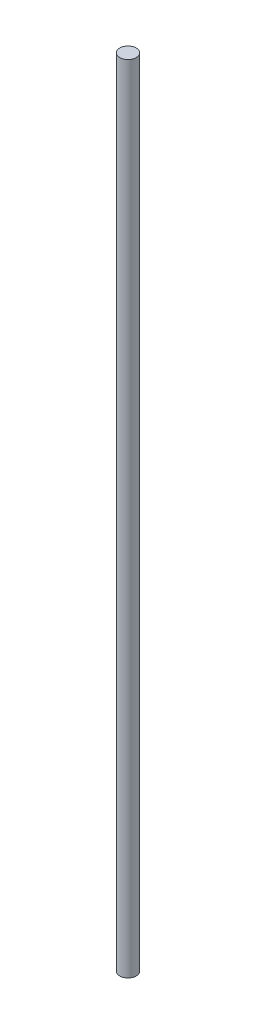
ISO-10303-21;
HEADER;
FILE_DESCRIPTION(('STEP AP214'),'2;1');
FILE_NAME('part.step','',(''),(''),'','','');
FILE_SCHEMA(('AUTOMOTIVE_DESIGN { 1 0 10303 214 1 1 1 1 }'));
ENDSEC;
DATA;
#1=APPLICATION_CONTEXT('core data for automotive mechanical design processes');
#2=APPLICATION_PROTOCOL_DEFINITION('international standard','automotive_design',2000,#1);
#3=PRODUCT_CONTEXT('',#1,'mechanical');
#4=PRODUCT('Part','Part','',(#3));
#5=PRODUCT_RELATED_PRODUCT_CATEGORY('part','',(#4));
#6=PRODUCT_DEFINITION_FORMATION('','',#4);
#7=PRODUCT_DEFINITION_CONTEXT('part definition',#1,'design');
#8=PRODUCT_DEFINITION('design','',#6,#7);
#9=PRODUCT_DEFINITION_SHAPE('','',#8);
#10=(LENGTH_UNIT() NAMED_UNIT(*) SI_UNIT(.MILLI.,.METRE.));
#11=(NAMED_UNIT(*) PLANE_ANGLE_UNIT() SI_UNIT($,.RADIAN.));
#12=(NAMED_UNIT(*) SI_UNIT($,.STERADIAN.) SOLID_ANGLE_UNIT());
#13=UNCERTAINTY_MEASURE_WITH_UNIT(LENGTH_MEASURE(1.E-05),#10,'distance_accuracy_value','');
#14=(GEOMETRIC_REPRESENTATION_CONTEXT(3) GLOBAL_UNCERTAINTY_ASSIGNED_CONTEXT((#13)) GLOBAL_UNIT_ASSIGNED_CONTEXT((#10,
#11,#12)) REPRESENTATION_CONTEXT('',''));
#15=CARTESIAN_POINT('',(0.,0.,0.));
#16=DIRECTION('',(0.,0.,1.));
#17=DIRECTION('',(1.,0.,0.));
#18=AXIS2_PLACEMENT_3D('',#15,#16,#17);
#19=CARTESIAN_POINT('',(0.,152.4,0.));
#20=DIRECTION('',(0.,-1.,0.));
#21=DIRECTION('',(0.,0.,-1.));
#22=AXIS2_PLACEMENT_3D('',#19,#20,#21);
#23=CYLINDRICAL_SURFACE('',#22,1.5875);
#24=CARTESIAN_POINT('',(0.,152.4,0.));
#25=DIRECTION('',(0.,1.,0.));
#26=DIRECTION('',(0.,0.,1.));
#27=AXIS2_PLACEMENT_3D('',#24,#25,#26);
#28=CIRCLE('',#27,1.5875);
#29=CARTESIAN_POINT('',(0.,152.4,1.5875));
#30=VERTEX_POINT('',#29);
#31=EDGE_CURVE('E10',#30,#30,#28,.T.);
#32=ORIENTED_EDGE('',*,*,#31,.F.);
#33=EDGE_LOOP('',(#32));
#34=FACE_BOUND('',#33,.T.);
#35=CARTESIAN_POINT('',(0.,0.,0.));
#36=DIRECTION('',(0.,1.,0.));
#37=DIRECTION('',(0.,0.,1.));
#38=AXIS2_PLACEMENT_3D('',#35,#36,#37);
#39=CIRCLE('',#38,1.5875);
#40=CARTESIAN_POINT('',(0.,0.,1.5875));
#41=VERTEX_POINT('',#40);
#42=EDGE_CURVE('E34',#41,#41,#39,.T.);
#43=ORIENTED_EDGE('',*,*,#42,.T.);
#44=EDGE_LOOP('',(#43));
#45=FACE_BOUND('',#44,.T.);
#46=ADVANCED_FACE('F31',(#34,#45),#23,.T.);
#47=CARTESIAN_POINT('',(0.,152.4,0.));
#48=DIRECTION('',(0.,1.,0.));
#49=DIRECTION('',(0.,0.,1.));
#50=AXIS2_PLACEMENT_3D('',#47,#48,#49);
#51=PLANE('',#50);
#52=ORIENTED_EDGE('',*,*,#31,.T.);
#53=EDGE_LOOP('',(#52));
#54=FACE_BOUND('',#53,.T.);
#55=ADVANCED_FACE('F46',(#54),#51,.T.);
#56=CARTESIAN_POINT('',(0.,0.,0.));
#57=DIRECTION('',(0.,1.,0.));
#58=DIRECTION('',(0.,0.,1.));
#59=AXIS2_PLACEMENT_3D('',#56,#57,#58);
#60=PLANE('',#59);
#61=ORIENTED_EDGE('',*,*,#42,.F.);
#62=EDGE_LOOP('',(#61));
#63=FACE_BOUND('',#62,.T.);
#64=ADVANCED_FACE('F44',(#63),#60,.F.);
#65=CLOSED_SHELL('',(#46,#55,#64));
#66=MANIFOLD_SOLID_BREP('B2',#65);
#67=ADVANCED_BREP_SHAPE_REPRESENTATION('',(#18,#66),#14);
#68=SHAPE_DEFINITION_REPRESENTATION(#9,#67);
ENDSEC;
END-ISO-10303-21;
